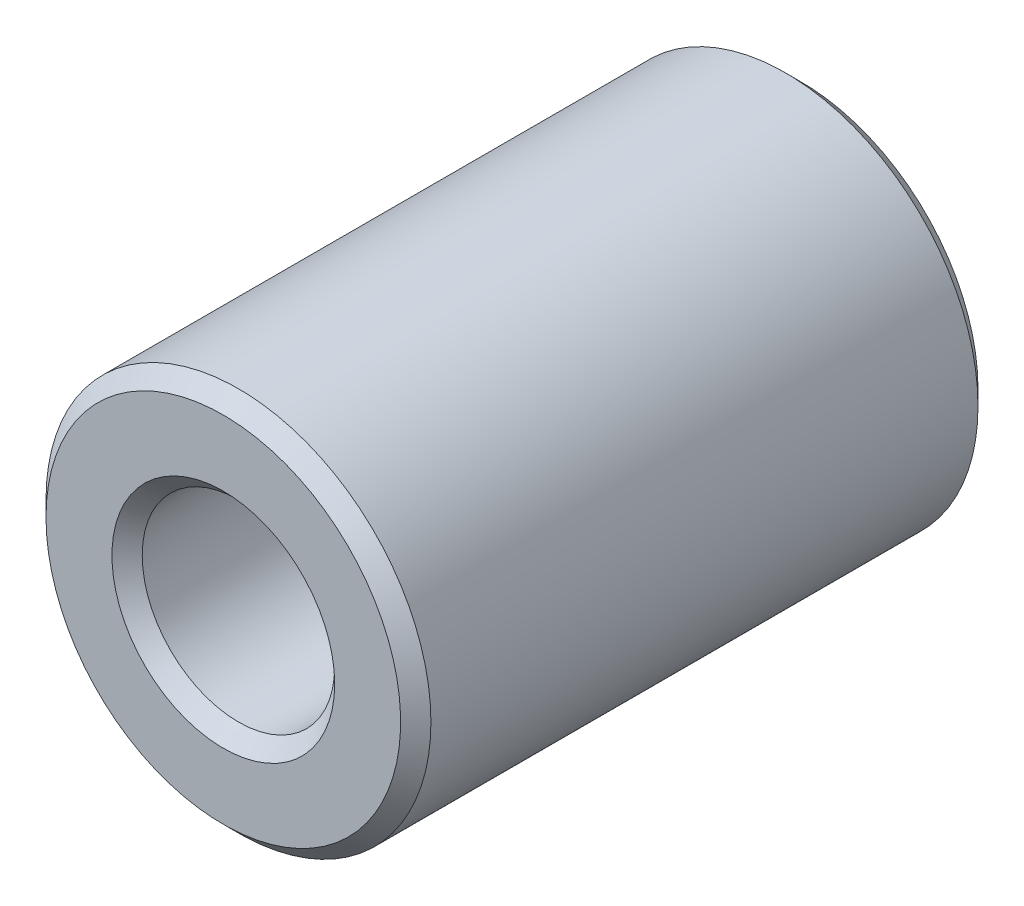
ISO-10303-21;
HEADER;
FILE_DESCRIPTION(('STEP AP214'),'2;1');
FILE_NAME('part.step','',(''),(''),'','','');
FILE_SCHEMA(('AUTOMOTIVE_DESIGN { 1 0 10303 214 1 1 1 1 }'));
ENDSEC;
DATA;
#1=APPLICATION_CONTEXT('core data for automotive mechanical design processes');
#2=APPLICATION_PROTOCOL_DEFINITION('international standard','automotive_design',2000,#1);
#3=PRODUCT_CONTEXT('',#1,'mechanical');
#4=PRODUCT('Part','Part','',(#3));
#5=PRODUCT_RELATED_PRODUCT_CATEGORY('part','',(#4));
#6=PRODUCT_DEFINITION_FORMATION('','',#4);
#7=PRODUCT_DEFINITION_CONTEXT('part definition',#1,'design');
#8=PRODUCT_DEFINITION('design','',#6,#7);
#9=PRODUCT_DEFINITION_SHAPE('','',#8);
#10=(LENGTH_UNIT() NAMED_UNIT(*) SI_UNIT(.MILLI.,.METRE.));
#11=(NAMED_UNIT(*) PLANE_ANGLE_UNIT() SI_UNIT($,.RADIAN.));
#12=(NAMED_UNIT(*) SI_UNIT($,.STERADIAN.) SOLID_ANGLE_UNIT());
#13=UNCERTAINTY_MEASURE_WITH_UNIT(LENGTH_MEASURE(1.E-05),#10,'distance_accuracy_value','');
#14=(GEOMETRIC_REPRESENTATION_CONTEXT(3) GLOBAL_UNCERTAINTY_ASSIGNED_CONTEXT((#13)) GLOBAL_UNIT_ASSIGNED_CONTEXT((#10,
#11,#12)) REPRESENTATION_CONTEXT('',''));
#15=CARTESIAN_POINT('',(0.,0.,0.));
#16=DIRECTION('',(0.,0.,1.));
#17=DIRECTION('',(1.,0.,0.));
#18=AXIS2_PLACEMENT_3D('',#15,#16,#17);
#19=CARTESIAN_POINT('',(0.,0.,19.05));
#20=DIRECTION('',(0.,0.,-1.));
#21=DIRECTION('',(-1.,0.,0.));
#22=AXIS2_PLACEMENT_3D('',#19,#20,#21);
#23=CYLINDRICAL_SURFACE('',#22,3.175);
#24=CARTESIAN_POINT('',(0.,0.,0.499999999988177));
#25=DIRECTION('',(0.,0.,-1.));
#26=DIRECTION('',(-1.,0.,0.));
#27=AXIS2_PLACEMENT_3D('',#24,#25,#26);
#28=CIRCLE('',#27,3.17500000005566);
#29=CARTESIAN_POINT('',(-3.17500000005566,0.,0.499999999988177));
#30=VERTEX_POINT('',#29);
#31=EDGE_CURVE('E30',#30,#30,#28,.T.);
#32=ORIENTED_EDGE('',*,*,#31,.T.);
#33=EDGE_LOOP('',(#32));
#34=FACE_BOUND('',#33,.T.);
#35=CARTESIAN_POINT('',(0.,0.,18.5499999999479));
#36=DIRECTION('',(0.,0.,1.));
#37=DIRECTION('',(1.,0.,0.));
#38=AXIS2_PLACEMENT_3D('',#35,#36,#37);
#39=CIRCLE('',#38,3.17499999999882);
#40=CARTESIAN_POINT('',(3.17499999999882,0.,18.5499999999479));
#41=VERTEX_POINT('',#40);
#42=EDGE_CURVE('E33',#41,#41,#39,.T.);
#43=ORIENTED_EDGE('',*,*,#42,.T.);
#44=EDGE_LOOP('',(#43));
#45=FACE_BOUND('',#44,.T.);
#46=ADVANCED_FACE('F15',(#34,#45),#23,.F.);
#47=CARTESIAN_POINT('',(0.,0.,19.0499999998792));
#48=DIRECTION('',(0.,0.,1.));
#49=DIRECTION('',(1.,0.,0.));
#50=AXIS2_PLACEMENT_3D('',#47,#48,#49);
#51=CONICAL_SURFACE('',#50,3.67499999993015,0.785398163397448);
#52=ORIENTED_EDGE('',*,*,#42,.F.);
#53=EDGE_LOOP('',(#52));
#54=FACE_BOUND('',#53,.T.);
#55=CARTESIAN_POINT('',(0.,0.,19.0499999999929));
#56=DIRECTION('',(0.,0.,1.));
#57=DIRECTION('',(1.,0.,0.));
#58=AXIS2_PLACEMENT_3D('',#55,#56,#57);
#59=CIRCLE('',#58,3.67500000004384);
#60=CARTESIAN_POINT('',(3.67500000004384,0.,19.0499999999929));
#61=VERTEX_POINT('',#60);
#62=EDGE_CURVE('E18',#61,#61,#59,.F.);
#63=ORIENTED_EDGE('',*,*,#62,.F.);
#64=EDGE_LOOP('',(#63));
#65=FACE_BOUND('',#64,.T.);
#66=ADVANCED_FACE('F49',(#54,#65),#51,.F.);
#67=CARTESIAN_POINT('',(0.,0.,5.6843418860808E-11));
#68=DIRECTION('',(0.,0.,-1.));
#69=DIRECTION('',(-1.,0.,0.));
#70=AXIS2_PLACEMENT_3D('',#67,#68,#69);
#71=CONICAL_SURFACE('',#70,3.67499999998699,0.785398163397448);
#72=CARTESIAN_POINT('',(0.,0.,5.6843418860808E-11));
#73=DIRECTION('',(0.,0.,-1.));
#74=DIRECTION('',(-1.,0.,0.));
#75=AXIS2_PLACEMENT_3D('',#72,#73,#74);
#76=CIRCLE('',#75,3.67499999998699);
#77=CARTESIAN_POINT('',(-3.67499999998699,0.,5.6843418860808E-11));
#78=VERTEX_POINT('',#77);
#79=EDGE_CURVE('E40',#78,#78,#76,.T.);
#80=ORIENTED_EDGE('',*,*,#79,.T.);
#81=EDGE_LOOP('',(#80));
#82=FACE_BOUND('',#81,.T.);
#83=ORIENTED_EDGE('',*,*,#31,.F.);
#84=EDGE_LOOP('',(#83));
#85=FACE_BOUND('',#84,.T.);
#86=ADVANCED_FACE('F51',(#82,#85),#71,.F.);
#87=CARTESIAN_POINT('',(0.,0.,19.05));
#88=DIRECTION('',(0.,0.,1.));
#89=DIRECTION('',(1.,0.,0.));
#90=AXIS2_PLACEMENT_3D('',#87,#88,#89);
#91=PLANE('',#90);
#92=CARTESIAN_POINT('',(0.,0.,19.0499999999929));
#93=DIRECTION('',(0.,0.,-1.));
#94=DIRECTION('',(-1.,0.,0.));
#95=AXIS2_PLACEMENT_3D('',#92,#93,#94);
#96=CIRCLE('',#95,5.85000000000946);
#97=CARTESIAN_POINT('',(-5.85000000000946,0.,19.0499999999929));
#98=VERTEX_POINT('',#97);
#99=EDGE_CURVE('E38',#98,#98,#96,.T.);
#100=ORIENTED_EDGE('',*,*,#99,.F.);
#101=EDGE_LOOP('',(#100));
#102=FACE_BOUND('',#101,.T.);
#103=ORIENTED_EDGE('',*,*,#62,.T.);
#104=EDGE_LOOP('',(#103));
#105=FACE_BOUND('',#104,.T.);
#106=ADVANCED_FACE('F47',(#102,#105),#91,.T.);
#107=CARTESIAN_POINT('',(0.,0.,0.));
#108=DIRECTION('',(0.,0.,1.));
#109=DIRECTION('',(1.,0.,0.));
#110=AXIS2_PLACEMENT_3D('',#107,#108,#109);
#111=PLANE('',#110);
#112=CARTESIAN_POINT('',(0.,0.,0.));
#113=DIRECTION('',(0.,0.,1.));
#114=DIRECTION('',(1.,0.,0.));
#115=AXIS2_PLACEMENT_3D('',#112,#113,#114);
#116=CIRCLE('',#115,5.85000000000946);
#117=CARTESIAN_POINT('',(5.85000000000946,0.,0.));
#118=VERTEX_POINT('',#117);
#119=EDGE_CURVE('E27',#118,#118,#116,.T.);
#120=ORIENTED_EDGE('',*,*,#119,.F.);
#121=EDGE_LOOP('',(#120));
#122=FACE_BOUND('',#121,.T.);
#123=ORIENTED_EDGE('',*,*,#79,.F.);
#124=EDGE_LOOP('',(#123));
#125=FACE_BOUND('',#124,.T.);
#126=ADVANCED_FACE('F75',(#122,#125),#111,.F.);
#127=CARTESIAN_POINT('',(0.,0.,18.5500000000616));
#128=DIRECTION('',(0.,0.,-1.));
#129=DIRECTION('',(-1.,0.,0.));
#130=AXIS2_PLACEMENT_3D('',#127,#128,#129);
#131=CONICAL_SURFACE('',#130,6.34999999994079,0.785398163397448);
#132=CARTESIAN_POINT('',(0.,0.,18.55));
#133=DIRECTION('',(0.,0.,-1.));
#134=DIRECTION('',(-1.,0.,0.));
#135=AXIS2_PLACEMENT_3D('',#132,#133,#134);
#136=CIRCLE('',#135,6.35);
#137=CARTESIAN_POINT('',(-6.35,0.,18.55));
#138=VERTEX_POINT('',#137);
#139=EDGE_CURVE('E22',#138,#138,#136,.T.);
#140=ORIENTED_EDGE('',*,*,#139,.F.);
#141=EDGE_LOOP('',(#140));
#142=FACE_BOUND('',#141,.T.);
#143=ORIENTED_EDGE('',*,*,#99,.T.);
#144=EDGE_LOOP('',(#143));
#145=FACE_BOUND('',#144,.T.);
#146=ADVANCED_FACE('F68',(#142,#145),#131,.T.);
#147=CARTESIAN_POINT('',(0.,0.,0.499999999931333));
#148=DIRECTION('',(0.,0.,1.));
#149=DIRECTION('',(1.,0.,0.));
#150=AXIS2_PLACEMENT_3D('',#147,#148,#149);
#151=CONICAL_SURFACE('',#150,6.34999999999764,0.785398163454292);
#152=CARTESIAN_POINT('',(0.,0.,0.500000000000014));
#153=DIRECTION('',(0.,0.,-1.));
#154=DIRECTION('',(-1.,0.,0.));
#155=AXIS2_PLACEMENT_3D('',#152,#153,#154);
#156=CIRCLE('',#155,6.35);
#157=CARTESIAN_POINT('',(-6.35,0.,0.500000000000014));
#158=VERTEX_POINT('',#157);
#159=EDGE_CURVE('E10',#158,#158,#156,.F.);
#160=ORIENTED_EDGE('',*,*,#159,.F.);
#161=EDGE_LOOP('',(#160));
#162=FACE_BOUND('',#161,.T.);
#163=ORIENTED_EDGE('',*,*,#119,.T.);
#164=EDGE_LOOP('',(#163));
#165=FACE_BOUND('',#164,.T.);
#166=ADVANCED_FACE('F63',(#162,#165),#151,.T.);
#167=CARTESIAN_POINT('',(0.,0.,19.05));
#168=DIRECTION('',(0.,0.,-1.));
#169=DIRECTION('',(-1.,0.,0.));
#170=AXIS2_PLACEMENT_3D('',#167,#168,#169);
#171=CYLINDRICAL_SURFACE('',#170,6.35);
#172=ORIENTED_EDGE('',*,*,#159,.T.);
#173=EDGE_LOOP('',(#172));
#174=FACE_BOUND('',#173,.T.);
#175=ORIENTED_EDGE('',*,*,#139,.T.);
#176=EDGE_LOOP('',(#175));
#177=FACE_BOUND('',#176,.T.);
#178=ADVANCED_FACE('F61',(#174,#177),#171,.T.);
#179=CLOSED_SHELL('',(#46,#66,#86,#106,#126,#146,#166,#178));
#180=MANIFOLD_SOLID_BREP('B1',#179);
#181=ADVANCED_BREP_SHAPE_REPRESENTATION('',(#18,#180),#14);
#182=SHAPE_DEFINITION_REPRESENTATION(#9,#181);
ENDSEC;
END-ISO-10303-21;
